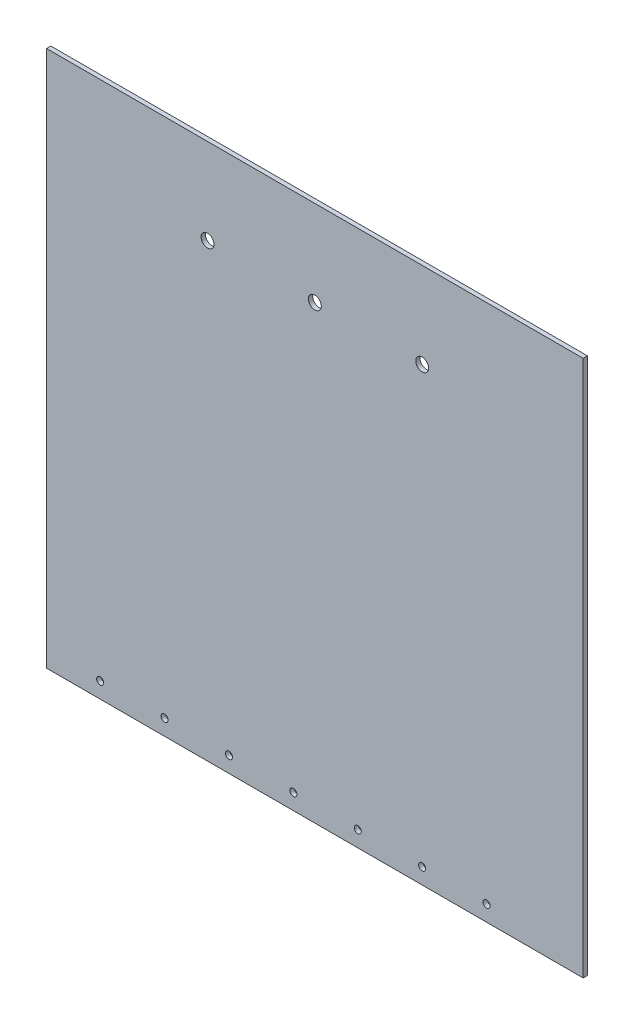
ISO-10303-21;
HEADER;
FILE_DESCRIPTION(('STEP AP214'),'2;1');
FILE_NAME('part.step','',(''),(''),'','','');
FILE_SCHEMA(('AUTOMOTIVE_DESIGN { 1 0 10303 214 1 1 1 1 }'));
ENDSEC;
DATA;
#1=APPLICATION_CONTEXT('core data for automotive mechanical design processes');
#2=APPLICATION_PROTOCOL_DEFINITION('international standard','automotive_design',2000,#1);
#3=PRODUCT_CONTEXT('',#1,'mechanical');
#4=PRODUCT('Part','Part','',(#3));
#5=PRODUCT_RELATED_PRODUCT_CATEGORY('part','',(#4));
#6=PRODUCT_DEFINITION_FORMATION('','',#4);
#7=PRODUCT_DEFINITION_CONTEXT('part definition',#1,'design');
#8=PRODUCT_DEFINITION('design','',#6,#7);
#9=PRODUCT_DEFINITION_SHAPE('','',#8);
#10=(LENGTH_UNIT() NAMED_UNIT(*) SI_UNIT(.MILLI.,.METRE.));
#11=(NAMED_UNIT(*) PLANE_ANGLE_UNIT() SI_UNIT($,.RADIAN.));
#12=(NAMED_UNIT(*) SI_UNIT($,.STERADIAN.) SOLID_ANGLE_UNIT());
#13=UNCERTAINTY_MEASURE_WITH_UNIT(LENGTH_MEASURE(1.E-05),#10,'distance_accuracy_value','');
#14=(GEOMETRIC_REPRESENTATION_CONTEXT(3) GLOBAL_UNCERTAINTY_ASSIGNED_CONTEXT((#13)) GLOBAL_UNIT_ASSIGNED_CONTEXT((#10,
#11,#12)) REPRESENTATION_CONTEXT('',''));
#15=CARTESIAN_POINT('',(0.,0.,0.));
#16=DIRECTION('',(0.,0.,1.));
#17=DIRECTION('',(1.,0.,0.));
#18=AXIS2_PLACEMENT_3D('',#15,#16,#17);
#19=CARTESIAN_POINT('',(-125.,-125.,2.));
#20=DIRECTION('',(1.,0.,0.));
#21=DIRECTION('',(0.,0.,-1.));
#22=AXIS2_PLACEMENT_3D('',#19,#20,#21);
#23=PLANE('',#22);
#24=DIRECTION('',(0.,-1.,0.));
#25=VECTOR('',#24,1.);
#26=CARTESIAN_POINT('',(-125.,-125.,0.));
#27=LINE('',#26,#25);
#28=CARTESIAN_POINT('',(-125.,125.,0.));
#29=VERTEX_POINT('',#28);
#30=CARTESIAN_POINT('',(-125.,-125.,0.));
#31=VERTEX_POINT('',#30);
#32=EDGE_CURVE('E100',#29,#31,#27,.T.);
#33=ORIENTED_EDGE('',*,*,#32,.T.);
#34=DIRECTION('',(0.,0.,-1.));
#35=VECTOR('',#34,1.);
#36=CARTESIAN_POINT('',(-125.,-125.,2.));
#37=LINE('',#36,#35);
#38=CARTESIAN_POINT('',(-125.,-125.,2.));
#39=VERTEX_POINT('',#38);
#40=EDGE_CURVE('E11',#39,#31,#37,.T.);
#41=ORIENTED_EDGE('',*,*,#40,.F.);
#42=DIRECTION('',(0.,-1.,0.));
#43=VECTOR('',#42,1.);
#44=CARTESIAN_POINT('',(-125.,-125.,2.));
#45=LINE('',#44,#43);
#46=CARTESIAN_POINT('',(-125.,125.,2.));
#47=VERTEX_POINT('',#46);
#48=EDGE_CURVE('E88',#47,#39,#45,.T.);
#49=ORIENTED_EDGE('',*,*,#48,.F.);
#50=DIRECTION('',(0.,0.,-1.));
#51=VECTOR('',#50,1.);
#52=CARTESIAN_POINT('',(-125.,125.,2.));
#53=LINE('',#52,#51);
#54=EDGE_CURVE('E96',#47,#29,#53,.T.);
#55=ORIENTED_EDGE('',*,*,#54,.T.);
#56=EDGE_LOOP('',(#33,#41,#49,#55));
#57=FACE_BOUND('',#56,.T.);
#58=ADVANCED_FACE('F37',(#57),#23,.F.);
#59=CARTESIAN_POINT('',(-125.,-125.,2.));
#60=DIRECTION('',(0.,1.,0.));
#61=DIRECTION('',(0.,0.,1.));
#62=AXIS2_PLACEMENT_3D('',#59,#60,#61);
#63=PLANE('',#62);
#64=DIRECTION('',(1.,0.,0.));
#65=VECTOR('',#64,1.);
#66=CARTESIAN_POINT('',(-125.,-125.,0.));
#67=LINE('',#66,#65);
#68=CARTESIAN_POINT('',(125.,-125.,0.));
#69=VERTEX_POINT('',#68);
#70=EDGE_CURVE('E92',#31,#69,#67,.T.);
#71=ORIENTED_EDGE('',*,*,#70,.T.);
#72=DIRECTION('',(0.,0.,-1.));
#73=VECTOR('',#72,1.);
#74=CARTESIAN_POINT('',(125.,-125.,2.));
#75=LINE('',#74,#73);
#76=CARTESIAN_POINT('',(125.,-125.,2.));
#77=VERTEX_POINT('',#76);
#78=EDGE_CURVE('E45',#77,#69,#75,.T.);
#79=ORIENTED_EDGE('',*,*,#78,.F.);
#80=DIRECTION('',(1.,0.,0.));
#81=VECTOR('',#80,1.);
#82=CARTESIAN_POINT('',(-125.,-125.,2.));
#83=LINE('',#82,#81);
#84=EDGE_CURVE('E83',#39,#77,#83,.T.);
#85=ORIENTED_EDGE('',*,*,#84,.F.);
#86=ORIENTED_EDGE('',*,*,#40,.T.);
#87=EDGE_LOOP('',(#71,#79,#85,#86));
#88=FACE_BOUND('',#87,.T.);
#89=ADVANCED_FACE('F91',(#88),#63,.F.);
#90=CARTESIAN_POINT('',(125.,-125.,2.));
#91=DIRECTION('',(-1.,0.,0.));
#92=DIRECTION('',(0.,0.,1.));
#93=AXIS2_PLACEMENT_3D('',#90,#91,#92);
#94=PLANE('',#93);
#95=DIRECTION('',(0.,1.,0.));
#96=VECTOR('',#95,1.);
#97=CARTESIAN_POINT('',(125.,-125.,0.));
#98=LINE('',#97,#96);
#99=CARTESIAN_POINT('',(125.,125.,0.));
#100=VERTEX_POINT('',#99);
#101=EDGE_CURVE('E70',#69,#100,#98,.T.);
#102=ORIENTED_EDGE('',*,*,#101,.T.);
#103=DIRECTION('',(0.,0.,-1.));
#104=VECTOR('',#103,1.);
#105=CARTESIAN_POINT('',(125.,125.,2.));
#106=LINE('',#105,#104);
#107=CARTESIAN_POINT('',(125.,125.,2.));
#108=VERTEX_POINT('',#107);
#109=EDGE_CURVE('E93',#108,#100,#106,.T.);
#110=ORIENTED_EDGE('',*,*,#109,.F.);
#111=DIRECTION('',(0.,1.,0.));
#112=VECTOR('',#111,1.);
#113=CARTESIAN_POINT('',(125.,-125.,2.));
#114=LINE('',#113,#112);
#115=EDGE_CURVE('E86',#77,#108,#114,.T.);
#116=ORIENTED_EDGE('',*,*,#115,.F.);
#117=ORIENTED_EDGE('',*,*,#78,.T.);
#118=EDGE_LOOP('',(#102,#110,#116,#117));
#119=FACE_BOUND('',#118,.T.);
#120=ADVANCED_FACE('F94',(#119),#94,.F.);
#121=CARTESIAN_POINT('',(-125.,125.,2.));
#122=DIRECTION('',(0.,-1.,0.));
#123=DIRECTION('',(0.,0.,-1.));
#124=AXIS2_PLACEMENT_3D('',#121,#122,#123);
#125=PLANE('',#124);
#126=DIRECTION('',(-1.,0.,0.));
#127=VECTOR('',#126,1.);
#128=CARTESIAN_POINT('',(-125.,125.,0.));
#129=LINE('',#128,#127);
#130=EDGE_CURVE('E76',#100,#29,#129,.T.);
#131=ORIENTED_EDGE('',*,*,#130,.T.);
#132=ORIENTED_EDGE('',*,*,#54,.F.);
#133=DIRECTION('',(-1.,0.,0.));
#134=VECTOR('',#133,1.);
#135=CARTESIAN_POINT('',(-125.,125.,2.));
#136=LINE('',#135,#134);
#137=EDGE_CURVE('E53',#108,#47,#136,.T.);
#138=ORIENTED_EDGE('',*,*,#137,.F.);
#139=ORIENTED_EDGE('',*,*,#109,.T.);
#140=EDGE_LOOP('',(#131,#132,#138,#139));
#141=FACE_BOUND('',#140,.T.);
#142=ADVANCED_FACE('F108',(#141),#125,.F.);
#143=CARTESIAN_POINT('',(0.,0.,2.));
#144=DIRECTION('',(0.,0.,-1.));
#145=DIRECTION('',(-1.,0.,0.));
#146=AXIS2_PLACEMENT_3D('',#143,#144,#145);
#147=PLANE('',#146);
#148=CARTESIAN_POINT('',(80.,-117.64,2.));
#149=DIRECTION('',(0.,0.,-1.));
#150=DIRECTION('',(-1.,0.,0.));
#151=AXIS2_PLACEMENT_3D('',#148,#149,#150);
#152=CIRCLE('',#151,1.65);
#153=CARTESIAN_POINT('',(78.35,-117.64,2.));
#154=VERTEX_POINT('',#153);
#155=EDGE_CURVE('E167',#154,#154,#152,.T.);
#156=ORIENTED_EDGE('',*,*,#155,.T.);
#157=EDGE_LOOP('',(#156));
#158=FACE_BOUND('',#157,.T.);
#159=CARTESIAN_POINT('',(50.,-117.64,2.));
#160=DIRECTION('',(0.,0.,-1.));
#161=DIRECTION('',(-1.,0.,0.));
#162=AXIS2_PLACEMENT_3D('',#159,#160,#161);
#163=CIRCLE('',#162,1.65);
#164=CARTESIAN_POINT('',(48.35,-117.64,2.));
#165=VERTEX_POINT('',#164);
#166=EDGE_CURVE('E161',#165,#165,#163,.T.);
#167=ORIENTED_EDGE('',*,*,#166,.T.);
#168=EDGE_LOOP('',(#167));
#169=FACE_BOUND('',#168,.T.);
#170=CARTESIAN_POINT('',(20.,-117.64,2.));
#171=DIRECTION('',(0.,0.,-1.));
#172=DIRECTION('',(-1.,0.,0.));
#173=AXIS2_PLACEMENT_3D('',#170,#171,#172);
#174=CIRCLE('',#173,1.65);
#175=CARTESIAN_POINT('',(18.35,-117.64,2.));
#176=VERTEX_POINT('',#175);
#177=EDGE_CURVE('E155',#176,#176,#174,.T.);
#178=ORIENTED_EDGE('',*,*,#177,.T.);
#179=EDGE_LOOP('',(#178));
#180=FACE_BOUND('',#179,.T.);
#181=CARTESIAN_POINT('',(-10.,-117.64,2.));
#182=DIRECTION('',(0.,0.,-1.));
#183=DIRECTION('',(-1.,0.,0.));
#184=AXIS2_PLACEMENT_3D('',#181,#182,#183);
#185=CIRCLE('',#184,1.65);
#186=CARTESIAN_POINT('',(-11.65,-117.64,2.));
#187=VERTEX_POINT('',#186);
#188=EDGE_CURVE('E149',#187,#187,#185,.T.);
#189=ORIENTED_EDGE('',*,*,#188,.T.);
#190=EDGE_LOOP('',(#189));
#191=FACE_BOUND('',#190,.T.);
#192=CARTESIAN_POINT('',(-40.,-117.64,2.));
#193=DIRECTION('',(0.,0.,-1.));
#194=DIRECTION('',(-1.,0.,0.));
#195=AXIS2_PLACEMENT_3D('',#192,#193,#194);
#196=CIRCLE('',#195,1.65);
#197=CARTESIAN_POINT('',(-41.65,-117.64,2.));
#198=VERTEX_POINT('',#197);
#199=EDGE_CURVE('E143',#198,#198,#196,.T.);
#200=ORIENTED_EDGE('',*,*,#199,.T.);
#201=EDGE_LOOP('',(#200));
#202=FACE_BOUND('',#201,.T.);
#203=CARTESIAN_POINT('',(-70.,-117.64,2.));
#204=DIRECTION('',(0.,0.,-1.));
#205=DIRECTION('',(-1.,0.,0.));
#206=AXIS2_PLACEMENT_3D('',#203,#204,#205);
#207=CIRCLE('',#206,1.65);
#208=CARTESIAN_POINT('',(-71.65,-117.64,2.));
#209=VERTEX_POINT('',#208);
#210=EDGE_CURVE('E137',#209,#209,#207,.T.);
#211=ORIENTED_EDGE('',*,*,#210,.T.);
#212=EDGE_LOOP('',(#211));
#213=FACE_BOUND('',#212,.T.);
#214=CARTESIAN_POINT('',(-100.,-117.64,2.));
#215=DIRECTION('',(0.,0.,-1.));
#216=DIRECTION('',(-1.,0.,0.));
#217=AXIS2_PLACEMENT_3D('',#214,#215,#216);
#218=CIRCLE('',#217,1.65);
#219=CARTESIAN_POINT('',(-101.65,-117.64,2.));
#220=VERTEX_POINT('',#219);
#221=EDGE_CURVE('E124',#220,#220,#218,.T.);
#222=ORIENTED_EDGE('',*,*,#221,.T.);
#223=EDGE_LOOP('',(#222));
#224=FACE_BOUND('',#223,.T.);
#225=CARTESIAN_POINT('',(50.,85.,2.));
#226=DIRECTION('',(0.,0.,1.));
#227=DIRECTION('',(1.,0.,0.));
#228=AXIS2_PLACEMENT_3D('',#225,#226,#227);
#229=CIRCLE('',#228,2.99999999999999);
#230=CARTESIAN_POINT('',(53.,85.,2.));
#231=VERTEX_POINT('',#230);
#232=EDGE_CURVE('E120',#231,#231,#229,.T.);
#233=ORIENTED_EDGE('',*,*,#232,.F.);
#234=EDGE_LOOP('',(#233));
#235=FACE_BOUND('',#234,.T.);
#236=CARTESIAN_POINT('',(-50.,85.,2.));
#237=DIRECTION('',(0.,0.,1.));
#238=DIRECTION('',(1.,0.,0.));
#239=AXIS2_PLACEMENT_3D('',#236,#237,#238);
#240=CIRCLE('',#239,3.);
#241=CARTESIAN_POINT('',(-47.,85.,2.));
#242=VERTEX_POINT('',#241);
#243=EDGE_CURVE('E127',#242,#242,#240,.T.);
#244=ORIENTED_EDGE('',*,*,#243,.F.);
#245=EDGE_LOOP('',(#244));
#246=FACE_BOUND('',#245,.T.);
#247=CARTESIAN_POINT('',(0.,85.,2.));
#248=DIRECTION('',(0.,0.,1.));
#249=DIRECTION('',(1.,0.,0.));
#250=AXIS2_PLACEMENT_3D('',#247,#248,#249);
#251=CIRCLE('',#250,3.);
#252=CARTESIAN_POINT('',(3.,85.,2.));
#253=VERTEX_POINT('',#252);
#254=EDGE_CURVE('E114',#253,#253,#251,.T.);
#255=ORIENTED_EDGE('',*,*,#254,.F.);
#256=EDGE_LOOP('',(#255));
#257=FACE_BOUND('',#256,.T.);
#258=ORIENTED_EDGE('',*,*,#48,.T.);
#259=ORIENTED_EDGE('',*,*,#84,.T.);
#260=ORIENTED_EDGE('',*,*,#115,.T.);
#261=ORIENTED_EDGE('',*,*,#137,.T.);
#262=EDGE_LOOP('',(#258,#259,#260,#261));
#263=FACE_BOUND('',#262,.T.);
#264=ADVANCED_FACE('F84',(#158,#169,#180,#191,#202,#213,#224,#235,#246,#257,#263),#147,.F.);
#265=CARTESIAN_POINT('',(0.,0.,0.));
#266=DIRECTION('',(0.,0.,-1.));
#267=DIRECTION('',(-1.,0.,0.));
#268=AXIS2_PLACEMENT_3D('',#265,#266,#267);
#269=PLANE('',#268);
#270=CARTESIAN_POINT('',(80.,-117.64,0.));
#271=DIRECTION('',(0.,0.,-1.));
#272=DIRECTION('',(-1.,0.,0.));
#273=AXIS2_PLACEMENT_3D('',#270,#271,#272);
#274=CIRCLE('',#273,1.64999999999998);
#275=CARTESIAN_POINT('',(78.35,-117.64,0.));
#276=VERTEX_POINT('',#275);
#277=EDGE_CURVE('E170',#276,#276,#274,.T.);
#278=ORIENTED_EDGE('',*,*,#277,.F.);
#279=EDGE_LOOP('',(#278));
#280=FACE_BOUND('',#279,.T.);
#281=CARTESIAN_POINT('',(50.,-117.64,0.));
#282=DIRECTION('',(0.,0.,-1.));
#283=DIRECTION('',(-1.,0.,0.));
#284=AXIS2_PLACEMENT_3D('',#281,#282,#283);
#285=CIRCLE('',#284,1.64999999999998);
#286=CARTESIAN_POINT('',(48.35,-117.64,0.));
#287=VERTEX_POINT('',#286);
#288=EDGE_CURVE('E164',#287,#287,#285,.T.);
#289=ORIENTED_EDGE('',*,*,#288,.F.);
#290=EDGE_LOOP('',(#289));
#291=FACE_BOUND('',#290,.T.);
#292=CARTESIAN_POINT('',(20.,-117.64,0.));
#293=DIRECTION('',(0.,0.,-1.));
#294=DIRECTION('',(-1.,0.,0.));
#295=AXIS2_PLACEMENT_3D('',#292,#293,#294);
#296=CIRCLE('',#295,1.64999999999999);
#297=CARTESIAN_POINT('',(18.35,-117.64,0.));
#298=VERTEX_POINT('',#297);
#299=EDGE_CURVE('E158',#298,#298,#296,.T.);
#300=ORIENTED_EDGE('',*,*,#299,.F.);
#301=EDGE_LOOP('',(#300));
#302=FACE_BOUND('',#301,.T.);
#303=CARTESIAN_POINT('',(-10.,-117.64,0.));
#304=DIRECTION('',(0.,0.,-1.));
#305=DIRECTION('',(-1.,0.,0.));
#306=AXIS2_PLACEMENT_3D('',#303,#304,#305);
#307=CIRCLE('',#306,1.64999999999999);
#308=CARTESIAN_POINT('',(-11.65,-117.64,0.));
#309=VERTEX_POINT('',#308);
#310=EDGE_CURVE('E152',#309,#309,#307,.T.);
#311=ORIENTED_EDGE('',*,*,#310,.F.);
#312=EDGE_LOOP('',(#311));
#313=FACE_BOUND('',#312,.T.);
#314=CARTESIAN_POINT('',(-40.,-117.64,0.));
#315=DIRECTION('',(0.,0.,-1.));
#316=DIRECTION('',(-1.,0.,0.));
#317=AXIS2_PLACEMENT_3D('',#314,#315,#316);
#318=CIRCLE('',#317,1.64999999999998);
#319=CARTESIAN_POINT('',(-41.65,-117.64,0.));
#320=VERTEX_POINT('',#319);
#321=EDGE_CURVE('E146',#320,#320,#318,.T.);
#322=ORIENTED_EDGE('',*,*,#321,.F.);
#323=EDGE_LOOP('',(#322));
#324=FACE_BOUND('',#323,.T.);
#325=CARTESIAN_POINT('',(-70.,-117.64,0.));
#326=DIRECTION('',(0.,0.,-1.));
#327=DIRECTION('',(-1.,0.,0.));
#328=AXIS2_PLACEMENT_3D('',#325,#326,#327);
#329=CIRCLE('',#328,1.64999999999998);
#330=CARTESIAN_POINT('',(-71.65,-117.64,0.));
#331=VERTEX_POINT('',#330);
#332=EDGE_CURVE('E140',#331,#331,#329,.T.);
#333=ORIENTED_EDGE('',*,*,#332,.F.);
#334=EDGE_LOOP('',(#333));
#335=FACE_BOUND('',#334,.T.);
#336=CARTESIAN_POINT('',(-100.,-117.64,0.));
#337=DIRECTION('',(0.,0.,-1.));
#338=DIRECTION('',(-1.,0.,0.));
#339=AXIS2_PLACEMENT_3D('',#336,#337,#338);
#340=CIRCLE('',#339,1.64999999999998);
#341=CARTESIAN_POINT('',(-101.65,-117.64,0.));
#342=VERTEX_POINT('',#341);
#343=EDGE_CURVE('E134',#342,#342,#340,.T.);
#344=ORIENTED_EDGE('',*,*,#343,.F.);
#345=EDGE_LOOP('',(#344));
#346=FACE_BOUND('',#345,.T.);
#347=CARTESIAN_POINT('',(50.,85.,0.));
#348=DIRECTION('',(0.,0.,1.));
#349=DIRECTION('',(1.,0.,0.));
#350=AXIS2_PLACEMENT_3D('',#347,#348,#349);
#351=CIRCLE('',#350,2.99999999999999);
#352=CARTESIAN_POINT('',(53.,85.,0.));
#353=VERTEX_POINT('',#352);
#354=EDGE_CURVE('E123',#353,#353,#351,.T.);
#355=ORIENTED_EDGE('',*,*,#354,.T.);
#356=EDGE_LOOP('',(#355));
#357=FACE_BOUND('',#356,.T.);
#358=CARTESIAN_POINT('',(-50.,85.,0.));
#359=DIRECTION('',(0.,0.,1.));
#360=DIRECTION('',(1.,0.,0.));
#361=AXIS2_PLACEMENT_3D('',#358,#359,#360);
#362=CIRCLE('',#361,3.);
#363=CARTESIAN_POINT('',(-47.,85.,0.));
#364=VERTEX_POINT('',#363);
#365=EDGE_CURVE('E117',#364,#364,#362,.T.);
#366=ORIENTED_EDGE('',*,*,#365,.T.);
#367=EDGE_LOOP('',(#366));
#368=FACE_BOUND('',#367,.T.);
#369=CARTESIAN_POINT('',(0.,85.,0.));
#370=DIRECTION('',(0.,0.,1.));
#371=DIRECTION('',(1.,0.,0.));
#372=AXIS2_PLACEMENT_3D('',#369,#370,#371);
#373=CIRCLE('',#372,3.);
#374=CARTESIAN_POINT('',(3.,85.,0.));
#375=VERTEX_POINT('',#374);
#376=EDGE_CURVE('E103',#375,#375,#373,.T.);
#377=ORIENTED_EDGE('',*,*,#376,.T.);
#378=EDGE_LOOP('',(#377));
#379=FACE_BOUND('',#378,.T.);
#380=ORIENTED_EDGE('',*,*,#32,.F.);
#381=ORIENTED_EDGE('',*,*,#130,.F.);
#382=ORIENTED_EDGE('',*,*,#101,.F.);
#383=ORIENTED_EDGE('',*,*,#70,.F.);
#384=EDGE_LOOP('',(#380,#381,#382,#383));
#385=FACE_BOUND('',#384,.T.);
#386=ADVANCED_FACE('F111',(#280,#291,#302,#313,#324,#335,#346,#357,#368,#379,#385),#269,.T.);
#387=CARTESIAN_POINT('',(0.,85.,0.));
#388=DIRECTION('',(0.,0.,1.));
#389=DIRECTION('',(1.,0.,0.));
#390=AXIS2_PLACEMENT_3D('',#387,#388,#389);
#391=CYLINDRICAL_SURFACE('',#390,3.);
#392=ORIENTED_EDGE('',*,*,#376,.F.);
#393=EDGE_LOOP('',(#392));
#394=FACE_BOUND('',#393,.T.);
#395=ORIENTED_EDGE('',*,*,#254,.T.);
#396=EDGE_LOOP('',(#395));
#397=FACE_BOUND('',#396,.T.);
#398=ADVANCED_FACE('F178',(#394,#397),#391,.F.);
#399=CARTESIAN_POINT('',(-50.,85.,0.));
#400=DIRECTION('',(0.,0.,1.));
#401=DIRECTION('',(1.,0.,0.));
#402=AXIS2_PLACEMENT_3D('',#399,#400,#401);
#403=CYLINDRICAL_SURFACE('',#402,3.);
#404=ORIENTED_EDGE('',*,*,#365,.F.);
#405=EDGE_LOOP('',(#404));
#406=FACE_BOUND('',#405,.T.);
#407=ORIENTED_EDGE('',*,*,#243,.T.);
#408=EDGE_LOOP('',(#407));
#409=FACE_BOUND('',#408,.T.);
#410=ADVANCED_FACE('F200',(#406,#409),#403,.F.);
#411=CARTESIAN_POINT('',(50.,85.,0.));
#412=DIRECTION('',(0.,0.,1.));
#413=DIRECTION('',(1.,0.,0.));
#414=AXIS2_PLACEMENT_3D('',#411,#412,#413);
#415=CYLINDRICAL_SURFACE('',#414,2.99999999999999);
#416=ORIENTED_EDGE('',*,*,#354,.F.);
#417=EDGE_LOOP('',(#416));
#418=FACE_BOUND('',#417,.T.);
#419=ORIENTED_EDGE('',*,*,#232,.T.);
#420=EDGE_LOOP('',(#419));
#421=FACE_BOUND('',#420,.T.);
#422=ADVANCED_FACE('F243',(#418,#421),#415,.F.);
#423=CARTESIAN_POINT('',(-100.,-117.64,0.));
#424=DIRECTION('',(0.,0.,-1.));
#425=DIRECTION('',(-1.,0.,0.));
#426=AXIS2_PLACEMENT_3D('',#423,#424,#425);
#427=CYLINDRICAL_SURFACE('',#426,1.64999999999999);
#428=ORIENTED_EDGE('',*,*,#221,.F.);
#429=EDGE_LOOP('',(#428));
#430=FACE_BOUND('',#429,.T.);
#431=ORIENTED_EDGE('',*,*,#343,.T.);
#432=EDGE_LOOP('',(#431));
#433=FACE_BOUND('',#432,.T.);
#434=ADVANCED_FACE('F252',(#430,#433),#427,.F.);
#435=CARTESIAN_POINT('',(-70.,-117.64,0.));
#436=DIRECTION('',(0.,0.,-1.));
#437=DIRECTION('',(-1.,0.,0.));
#438=AXIS2_PLACEMENT_3D('',#435,#436,#437);
#439=CYLINDRICAL_SURFACE('',#438,1.64999999999999);
#440=ORIENTED_EDGE('',*,*,#210,.F.);
#441=EDGE_LOOP('',(#440));
#442=FACE_BOUND('',#441,.T.);
#443=ORIENTED_EDGE('',*,*,#332,.T.);
#444=EDGE_LOOP('',(#443));
#445=FACE_BOUND('',#444,.T.);
#446=ADVANCED_FACE('F276',(#442,#445),#439,.F.);
#447=CARTESIAN_POINT('',(-40.,-117.64,0.));
#448=DIRECTION('',(0.,0.,-1.));
#449=DIRECTION('',(-1.,0.,0.));
#450=AXIS2_PLACEMENT_3D('',#447,#448,#449);
#451=CYLINDRICAL_SURFACE('',#450,1.64999999999999);
#452=ORIENTED_EDGE('',*,*,#199,.F.);
#453=EDGE_LOOP('',(#452));
#454=FACE_BOUND('',#453,.T.);
#455=ORIENTED_EDGE('',*,*,#321,.T.);
#456=EDGE_LOOP('',(#455));
#457=FACE_BOUND('',#456,.T.);
#458=ADVANCED_FACE('F287',(#454,#457),#451,.F.);
#459=CARTESIAN_POINT('',(-10.,-117.64,0.));
#460=DIRECTION('',(0.,0.,-1.));
#461=DIRECTION('',(-1.,0.,0.));
#462=AXIS2_PLACEMENT_3D('',#459,#460,#461);
#463=CYLINDRICAL_SURFACE('',#462,1.64999999999999);
#464=ORIENTED_EDGE('',*,*,#188,.F.);
#465=EDGE_LOOP('',(#464));
#466=FACE_BOUND('',#465,.T.);
#467=ORIENTED_EDGE('',*,*,#310,.T.);
#468=EDGE_LOOP('',(#467));
#469=FACE_BOUND('',#468,.T.);
#470=ADVANCED_FACE('F299',(#466,#469),#463,.F.);
#471=CARTESIAN_POINT('',(20.,-117.64,0.));
#472=DIRECTION('',(0.,0.,-1.));
#473=DIRECTION('',(-1.,0.,0.));
#474=AXIS2_PLACEMENT_3D('',#471,#472,#473);
#475=CYLINDRICAL_SURFACE('',#474,1.64999999999999);
#476=ORIENTED_EDGE('',*,*,#177,.F.);
#477=EDGE_LOOP('',(#476));
#478=FACE_BOUND('',#477,.T.);
#479=ORIENTED_EDGE('',*,*,#299,.T.);
#480=EDGE_LOOP('',(#479));
#481=FACE_BOUND('',#480,.T.);
#482=ADVANCED_FACE('F311',(#478,#481),#475,.F.);
#483=CARTESIAN_POINT('',(50.,-117.64,0.));
#484=DIRECTION('',(0.,0.,-1.));
#485=DIRECTION('',(-1.,0.,0.));
#486=AXIS2_PLACEMENT_3D('',#483,#484,#485);
#487=CYLINDRICAL_SURFACE('',#486,1.64999999999999);
#488=ORIENTED_EDGE('',*,*,#166,.F.);
#489=EDGE_LOOP('',(#488));
#490=FACE_BOUND('',#489,.T.);
#491=ORIENTED_EDGE('',*,*,#288,.T.);
#492=EDGE_LOOP('',(#491));
#493=FACE_BOUND('',#492,.T.);
#494=ADVANCED_FACE('F323',(#490,#493),#487,.F.);
#495=CARTESIAN_POINT('',(80.,-117.64,0.));
#496=DIRECTION('',(0.,0.,-1.));
#497=DIRECTION('',(-1.,0.,0.));
#498=AXIS2_PLACEMENT_3D('',#495,#496,#497);
#499=CYLINDRICAL_SURFACE('',#498,1.64999999999999);
#500=ORIENTED_EDGE('',*,*,#155,.F.);
#501=EDGE_LOOP('',(#500));
#502=FACE_BOUND('',#501,.T.);
#503=ORIENTED_EDGE('',*,*,#277,.T.);
#504=EDGE_LOOP('',(#503));
#505=FACE_BOUND('',#504,.T.);
#506=ADVANCED_FACE('F174',(#502,#505),#499,.F.);
#507=CLOSED_SHELL('',(#58,#89,#120,#142,#264,#386,#398,#410,#422,#434,#446,#458,#470,#482,#494,#506));
#508=MANIFOLD_SOLID_BREP('B2',#507);
#509=ADVANCED_BREP_SHAPE_REPRESENTATION('',(#18,#508),#14);
#510=SHAPE_DEFINITION_REPRESENTATION(#9,#509);
ENDSEC;
END-ISO-10303-21;
